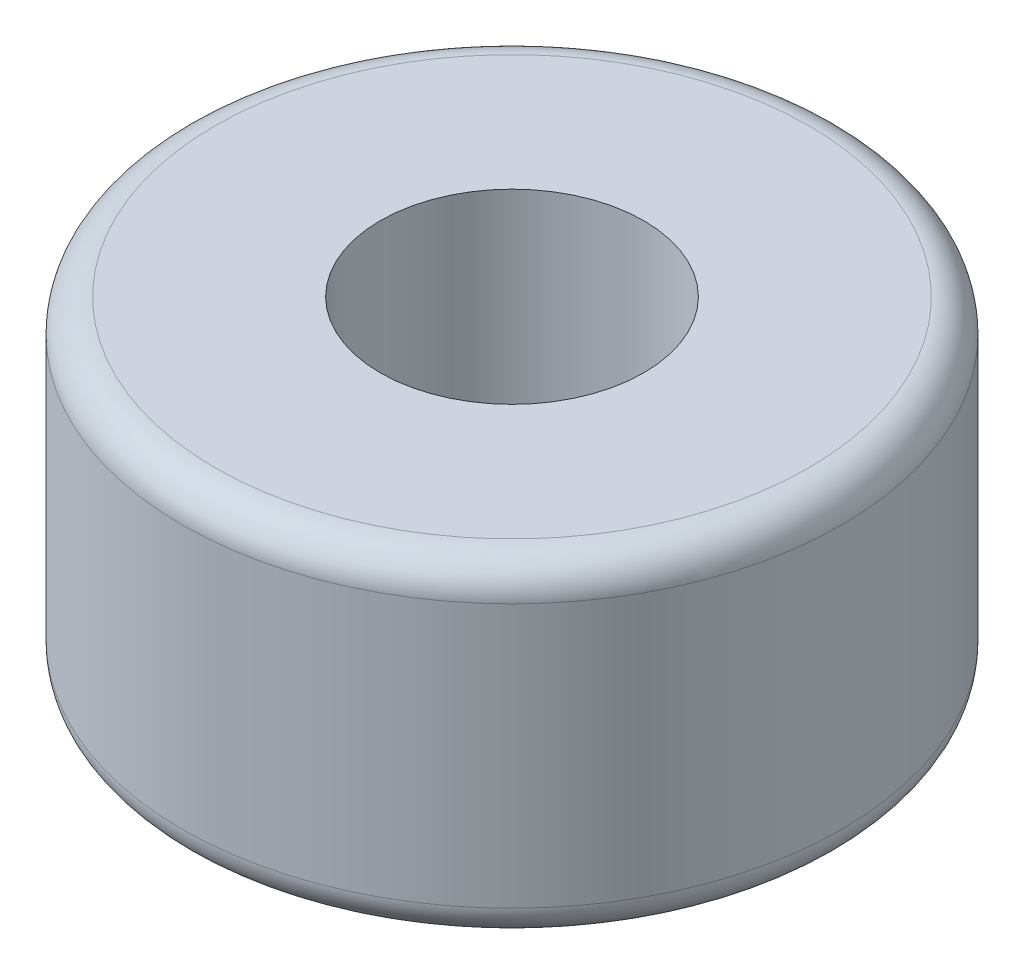
ISO-10303-21;
HEADER;
FILE_DESCRIPTION(('STEP AP214'),'2;1');
FILE_NAME('part.step','',(''),(''),'','','');
FILE_SCHEMA(('AUTOMOTIVE_DESIGN { 1 0 10303 214 1 1 1 1 }'));
ENDSEC;
DATA;
#1=APPLICATION_CONTEXT('core data for automotive mechanical design processes');
#2=APPLICATION_PROTOCOL_DEFINITION('international standard','automotive_design',2000,#1);
#3=PRODUCT_CONTEXT('',#1,'mechanical');
#4=PRODUCT('Part','Part','',(#3));
#5=PRODUCT_RELATED_PRODUCT_CATEGORY('part','',(#4));
#6=PRODUCT_DEFINITION_FORMATION('','',#4);
#7=PRODUCT_DEFINITION_CONTEXT('part definition',#1,'design');
#8=PRODUCT_DEFINITION('design','',#6,#7);
#9=PRODUCT_DEFINITION_SHAPE('','',#8);
#10=(LENGTH_UNIT() NAMED_UNIT(*) SI_UNIT(.MILLI.,.METRE.));
#11=(NAMED_UNIT(*) PLANE_ANGLE_UNIT() SI_UNIT($,.RADIAN.));
#12=(NAMED_UNIT(*) SI_UNIT($,.STERADIAN.) SOLID_ANGLE_UNIT());
#13=UNCERTAINTY_MEASURE_WITH_UNIT(LENGTH_MEASURE(1.E-05),#10,'distance_accuracy_value','');
#14=(GEOMETRIC_REPRESENTATION_CONTEXT(3) GLOBAL_UNCERTAINTY_ASSIGNED_CONTEXT((#13)) GLOBAL_UNIT_ASSIGNED_CONTEXT((#10,
#11,#12)) REPRESENTATION_CONTEXT('',''));
#15=CARTESIAN_POINT('',(0.,0.,0.));
#16=DIRECTION('',(0.,0.,1.));
#17=DIRECTION('',(1.,0.,0.));
#18=AXIS2_PLACEMENT_3D('',#15,#16,#17);
#19=CARTESIAN_POINT('',(0.,10.,0.));
#20=DIRECTION('',(0.,1.,0.));
#21=DIRECTION('',(0.,0.,1.));
#22=AXIS2_PLACEMENT_3D('',#19,#20,#21);
#23=PLANE('',#22);
#24=CARTESIAN_POINT('',(0.,10.,0.));
#25=DIRECTION('',(0.,1.,0.));
#26=DIRECTION('',(0.,0.,1.));
#27=AXIS2_PLACEMENT_3D('',#24,#25,#26);
#28=CIRCLE('',#27,9.);
#29=CARTESIAN_POINT('',(0.,10.,9.));
#30=VERTEX_POINT('',#29);
#31=EDGE_CURVE('E10',#30,#30,#28,.T.);
#32=ORIENTED_EDGE('',*,*,#31,.T.);
#33=EDGE_LOOP('',(#32));
#34=FACE_BOUND('',#33,.T.);
#35=CARTESIAN_POINT('',(0.,10.,0.));
#36=DIRECTION('',(0.,1.,0.));
#37=DIRECTION('',(0.,0.,1.));
#38=AXIS2_PLACEMENT_3D('',#35,#36,#37);
#39=CIRCLE('',#38,4.);
#40=CARTESIAN_POINT('',(0.,10.,4.));
#41=VERTEX_POINT('',#40);
#42=EDGE_CURVE('E51',#41,#41,#39,.T.);
#43=ORIENTED_EDGE('',*,*,#42,.F.);
#44=EDGE_LOOP('',(#43));
#45=FACE_BOUND('',#44,.T.);
#46=ADVANCED_FACE('F31',(#34,#45),#23,.T.);
#47=CARTESIAN_POINT('',(0.,0.,0.));
#48=DIRECTION('',(0.,1.,0.));
#49=DIRECTION('',(0.,0.,1.));
#50=AXIS2_PLACEMENT_3D('',#47,#48,#49);
#51=PLANE('',#50);
#52=CARTESIAN_POINT('',(0.,0.,0.));
#53=DIRECTION('',(0.,1.,0.));
#54=DIRECTION('',(0.,0.,1.));
#55=AXIS2_PLACEMENT_3D('',#52,#53,#54);
#56=CIRCLE('',#55,9.);
#57=CARTESIAN_POINT('',(0.,0.,9.));
#58=VERTEX_POINT('',#57);
#59=EDGE_CURVE('E38',#58,#58,#56,.F.);
#60=ORIENTED_EDGE('',*,*,#59,.T.);
#61=EDGE_LOOP('',(#60));
#62=FACE_BOUND('',#61,.T.);
#63=CARTESIAN_POINT('',(0.,0.,0.));
#64=DIRECTION('',(0.,1.,0.));
#65=DIRECTION('',(0.,0.,1.));
#66=AXIS2_PLACEMENT_3D('',#63,#64,#65);
#67=CIRCLE('',#66,4.);
#68=CARTESIAN_POINT('',(0.,0.,4.));
#69=VERTEX_POINT('',#68);
#70=EDGE_CURVE('E52',#69,#69,#67,.T.);
#71=ORIENTED_EDGE('',*,*,#70,.T.);
#72=EDGE_LOOP('',(#71));
#73=FACE_BOUND('',#72,.T.);
#74=ADVANCED_FACE('F62',(#62,#73),#51,.F.);
#75=CARTESIAN_POINT('',(0.,10.,0.));
#76=DIRECTION('',(0.,-1.,0.));
#77=DIRECTION('',(0.,0.,-1.));
#78=AXIS2_PLACEMENT_3D('',#75,#76,#77);
#79=CYLINDRICAL_SURFACE('',#78,10.);
#80=CARTESIAN_POINT('',(0.,0.999999999999999,0.));
#81=DIRECTION('',(0.,1.,0.));
#82=DIRECTION('',(0.,0.,1.));
#83=AXIS2_PLACEMENT_3D('',#80,#81,#82);
#84=CIRCLE('',#83,10.);
#85=CARTESIAN_POINT('',(0.,0.999999999999999,10.));
#86=VERTEX_POINT('',#85);
#87=EDGE_CURVE('E42',#86,#86,#84,.T.);
#88=ORIENTED_EDGE('',*,*,#87,.T.);
#89=EDGE_LOOP('',(#88));
#90=FACE_BOUND('',#89,.T.);
#91=CARTESIAN_POINT('',(0.,9.,0.));
#92=DIRECTION('',(0.,1.,0.));
#93=DIRECTION('',(0.,0.,1.));
#94=AXIS2_PLACEMENT_3D('',#91,#92,#93);
#95=CIRCLE('',#94,10.);
#96=CARTESIAN_POINT('',(0.,9.,10.));
#97=VERTEX_POINT('',#96);
#98=EDGE_CURVE('E46',#97,#97,#95,.F.);
#99=ORIENTED_EDGE('',*,*,#98,.T.);
#100=EDGE_LOOP('',(#99));
#101=FACE_BOUND('',#100,.T.);
#102=ADVANCED_FACE('F67',(#90,#101),#79,.T.);
#103=CARTESIAN_POINT('',(0.,10.,0.));
#104=DIRECTION('',(0.,-1.,0.));
#105=DIRECTION('',(0.,0.,-1.));
#106=AXIS2_PLACEMENT_3D('',#103,#104,#105);
#107=CYLINDRICAL_SURFACE('',#106,4.);
#108=ORIENTED_EDGE('',*,*,#42,.T.);
#109=EDGE_LOOP('',(#108));
#110=FACE_BOUND('',#109,.T.);
#111=ORIENTED_EDGE('',*,*,#70,.F.);
#112=EDGE_LOOP('',(#111));
#113=FACE_BOUND('',#112,.T.);
#114=ADVANCED_FACE('F58',(#110,#113),#107,.F.);
#115=CARTESIAN_POINT('',(0.,0.999999999999999,0.));
#116=DIRECTION('',(0.,1.,0.));
#117=DIRECTION('',(0.,0.,1.));
#118=AXIS2_PLACEMENT_3D('',#115,#116,#117);
#119=TOROIDAL_SURFACE('',#118,9.,1.);
#120=ORIENTED_EDGE('',*,*,#59,.F.);
#121=EDGE_LOOP('',(#120));
#122=FACE_BOUND('',#121,.T.);
#123=ORIENTED_EDGE('',*,*,#87,.F.);
#124=EDGE_LOOP('',(#123));
#125=FACE_BOUND('',#124,.T.);
#126=ADVANCED_FACE('F73',(#122,#125),#119,.T.);
#127=CARTESIAN_POINT('',(0.,9.,0.));
#128=DIRECTION('',(0.,1.,0.));
#129=DIRECTION('',(0.,0.,1.));
#130=AXIS2_PLACEMENT_3D('',#127,#128,#129);
#131=TOROIDAL_SURFACE('',#130,9.,1.);
#132=ORIENTED_EDGE('',*,*,#98,.F.);
#133=EDGE_LOOP('',(#132));
#134=FACE_BOUND('',#133,.T.);
#135=ORIENTED_EDGE('',*,*,#31,.F.);
#136=EDGE_LOOP('',(#135));
#137=FACE_BOUND('',#136,.T.);
#138=ADVANCED_FACE('F33',(#134,#137),#131,.T.);
#139=CLOSED_SHELL('',(#46,#74,#102,#114,#126,#138));
#140=MANIFOLD_SOLID_BREP('B2',#139);
#141=ADVANCED_BREP_SHAPE_REPRESENTATION('',(#18,#140),#14);
#142=SHAPE_DEFINITION_REPRESENTATION(#9,#141);
ENDSEC;
END-ISO-10303-21;
